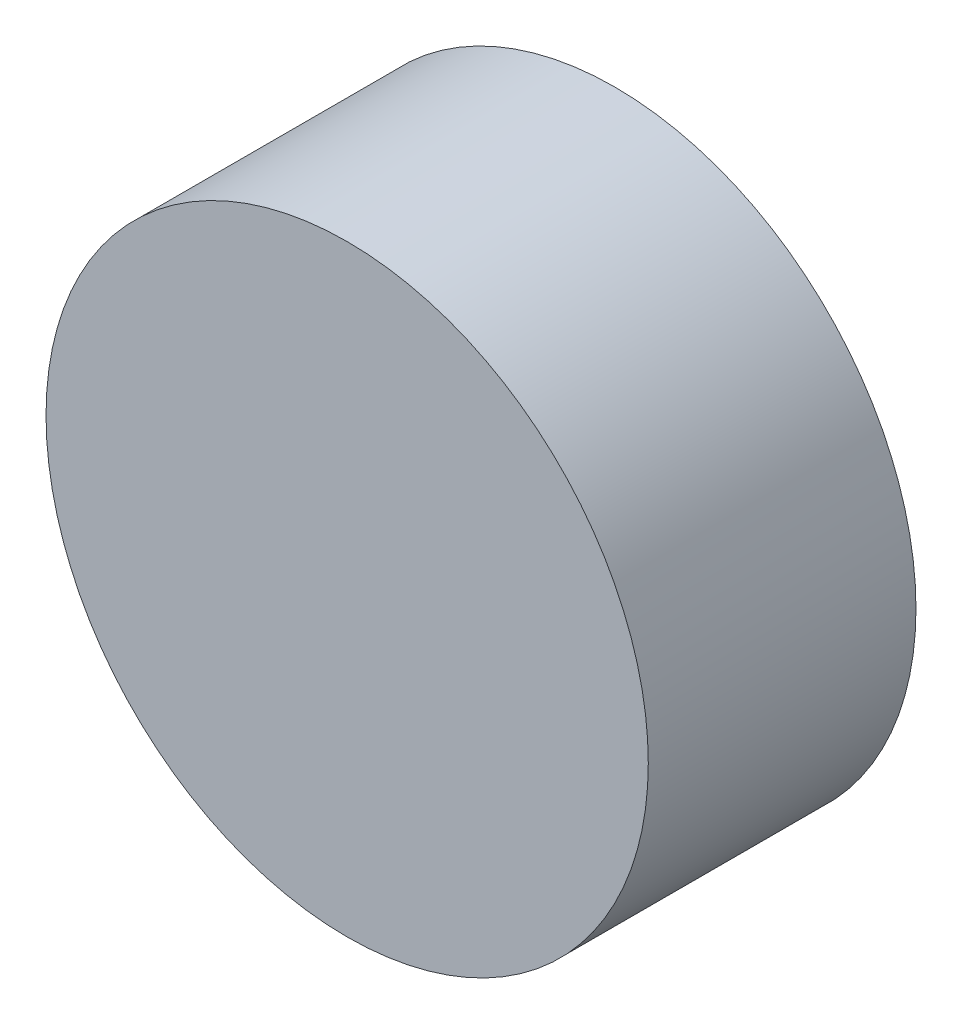
ISO-10303-21;
HEADER;
FILE_DESCRIPTION(('STEP AP214'),'2;1');
FILE_NAME('part.step','',(''),(''),'','','');
FILE_SCHEMA(('AUTOMOTIVE_DESIGN { 1 0 10303 214 1 1 1 1 }'));
ENDSEC;
DATA;
#1=APPLICATION_CONTEXT('core data for automotive mechanical design processes');
#2=APPLICATION_PROTOCOL_DEFINITION('international standard','automotive_design',2000,#1);
#3=PRODUCT_CONTEXT('',#1,'mechanical');
#4=PRODUCT('Part','Part','',(#3));
#5=PRODUCT_RELATED_PRODUCT_CATEGORY('part','',(#4));
#6=PRODUCT_DEFINITION_FORMATION('','',#4);
#7=PRODUCT_DEFINITION_CONTEXT('part definition',#1,'design');
#8=PRODUCT_DEFINITION('design','',#6,#7);
#9=PRODUCT_DEFINITION_SHAPE('','',#8);
#10=(LENGTH_UNIT() NAMED_UNIT(*) SI_UNIT(.MILLI.,.METRE.));
#11=(NAMED_UNIT(*) PLANE_ANGLE_UNIT() SI_UNIT($,.RADIAN.));
#12=(NAMED_UNIT(*) SI_UNIT($,.STERADIAN.) SOLID_ANGLE_UNIT());
#13=UNCERTAINTY_MEASURE_WITH_UNIT(LENGTH_MEASURE(1.E-05),#10,'distance_accuracy_value','');
#14=(GEOMETRIC_REPRESENTATION_CONTEXT(3) GLOBAL_UNCERTAINTY_ASSIGNED_CONTEXT((#13)) GLOBAL_UNIT_ASSIGNED_CONTEXT((#10,
#11,#12)) REPRESENTATION_CONTEXT('',''));
#15=CARTESIAN_POINT('',(0.,0.,0.));
#16=DIRECTION('',(0.,0.,1.));
#17=DIRECTION('',(1.,0.,0.));
#18=AXIS2_PLACEMENT_3D('',#15,#16,#17);
#19=CARTESIAN_POINT('',(0.,0.,20.));
#20=DIRECTION('',(0.,0.,-1.));
#21=DIRECTION('',(-1.,0.,0.));
#22=AXIS2_PLACEMENT_3D('',#19,#20,#21);
#23=CYLINDRICAL_SURFACE('',#22,22.5);
#24=CARTESIAN_POINT('',(0.,0.,20.));
#25=DIRECTION('',(0.,0.,1.));
#26=DIRECTION('',(1.,0.,0.));
#27=AXIS2_PLACEMENT_3D('',#24,#25,#26);
#28=CIRCLE('',#27,22.5);
#29=CARTESIAN_POINT('',(22.5,0.,20.));
#30=VERTEX_POINT('',#29);
#31=EDGE_CURVE('E10',#30,#30,#28,.T.);
#32=ORIENTED_EDGE('',*,*,#31,.F.);
#33=EDGE_LOOP('',(#32));
#34=FACE_BOUND('',#33,.T.);
#35=CARTESIAN_POINT('',(0.,0.,0.));
#36=DIRECTION('',(0.,0.,1.));
#37=DIRECTION('',(1.,0.,0.));
#38=AXIS2_PLACEMENT_3D('',#35,#36,#37);
#39=CIRCLE('',#38,22.5);
#40=CARTESIAN_POINT('',(22.5,0.,0.));
#41=VERTEX_POINT('',#40);
#42=EDGE_CURVE('E34',#41,#41,#39,.T.);
#43=ORIENTED_EDGE('',*,*,#42,.T.);
#44=EDGE_LOOP('',(#43));
#45=FACE_BOUND('',#44,.T.);
#46=ADVANCED_FACE('F31',(#34,#45),#23,.T.);
#47=CARTESIAN_POINT('',(0.,0.,20.));
#48=DIRECTION('',(0.,0.,1.));
#49=DIRECTION('',(1.,0.,0.));
#50=AXIS2_PLACEMENT_3D('',#47,#48,#49);
#51=PLANE('',#50);
#52=ORIENTED_EDGE('',*,*,#31,.T.);
#53=EDGE_LOOP('',(#52));
#54=FACE_BOUND('',#53,.T.);
#55=ADVANCED_FACE('F46',(#54),#51,.T.);
#56=CARTESIAN_POINT('',(0.,0.,0.));
#57=DIRECTION('',(0.,0.,1.));
#58=DIRECTION('',(1.,0.,0.));
#59=AXIS2_PLACEMENT_3D('',#56,#57,#58);
#60=PLANE('',#59);
#61=ORIENTED_EDGE('',*,*,#42,.F.);
#62=EDGE_LOOP('',(#61));
#63=FACE_BOUND('',#62,.T.);
#64=ADVANCED_FACE('F44',(#63),#60,.F.);
#65=CLOSED_SHELL('',(#46,#55,#64));
#66=MANIFOLD_SOLID_BREP('B2',#65);
#67=ADVANCED_BREP_SHAPE_REPRESENTATION('',(#18,#66),#14);
#68=SHAPE_DEFINITION_REPRESENTATION(#9,#67);
ENDSEC;
END-ISO-10303-21;
